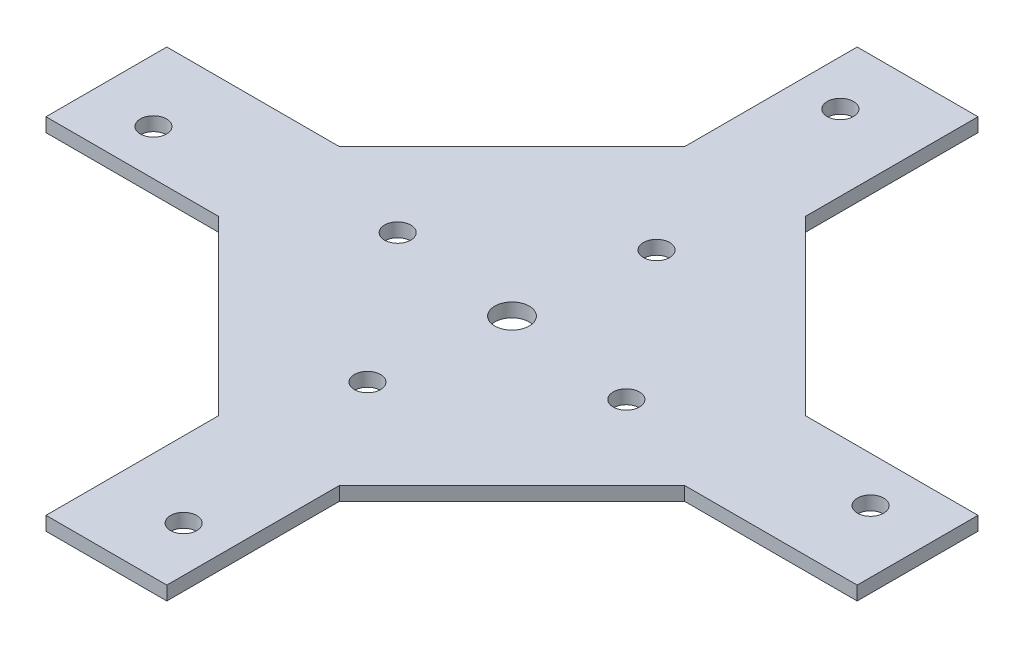
ISO-10303-21;
HEADER;
FILE_DESCRIPTION(('STEP AP214'),'2;1');
FILE_NAME('part.step','',(''),(''),'','','');
FILE_SCHEMA(('AUTOMOTIVE_DESIGN { 1 0 10303 214 1 1 1 1 }'));
ENDSEC;
DATA;
#1=APPLICATION_CONTEXT('core data for automotive mechanical design processes');
#2=APPLICATION_PROTOCOL_DEFINITION('international standard','automotive_design',2000,#1);
#3=PRODUCT_CONTEXT('',#1,'mechanical');
#4=PRODUCT('Part','Part','',(#3));
#5=PRODUCT_RELATED_PRODUCT_CATEGORY('part','',(#4));
#6=PRODUCT_DEFINITION_FORMATION('','',#4);
#7=PRODUCT_DEFINITION_CONTEXT('part definition',#1,'design');
#8=PRODUCT_DEFINITION('design','',#6,#7);
#9=PRODUCT_DEFINITION_SHAPE('','',#8);
#10=(LENGTH_UNIT() NAMED_UNIT(*) SI_UNIT(.MILLI.,.METRE.));
#11=(NAMED_UNIT(*) PLANE_ANGLE_UNIT() SI_UNIT($,.RADIAN.));
#12=(NAMED_UNIT(*) SI_UNIT($,.STERADIAN.) SOLID_ANGLE_UNIT());
#13=UNCERTAINTY_MEASURE_WITH_UNIT(LENGTH_MEASURE(1.E-05),#10,'distance_accuracy_value','');
#14=(GEOMETRIC_REPRESENTATION_CONTEXT(3) GLOBAL_UNCERTAINTY_ASSIGNED_CONTEXT((#13)) GLOBAL_UNIT_ASSIGNED_CONTEXT((#10,
#11,#12)) REPRESENTATION_CONTEXT('',''));
#15=CARTESIAN_POINT('',(0.,0.,0.));
#16=DIRECTION('',(0.,0.,1.));
#17=DIRECTION('',(1.,0.,0.));
#18=AXIS2_PLACEMENT_3D('',#15,#16,#17);
#19=CARTESIAN_POINT('',(0.,2.54,0.));
#20=DIRECTION('',(0.,-1.,0.));
#21=DIRECTION('',(0.,0.,-1.));
#22=AXIS2_PLACEMENT_3D('',#19,#20,#21);
#23=PLANE('',#22);
#24=CARTESIAN_POINT('',(0.,2.54,0.));
#25=DIRECTION('',(0.,1.,0.));
#26=DIRECTION('',(0.,0.,1.));
#27=AXIS2_PLACEMENT_3D('',#24,#25,#26);
#28=CIRCLE('',#27,3.175);
#29=CARTESIAN_POINT('',(0.,2.54,3.175));
#30=VERTEX_POINT('',#29);
#31=EDGE_CURVE('E407',#30,#30,#28,.T.);
#32=ORIENTED_EDGE('',*,*,#31,.F.);
#33=EDGE_LOOP('',(#32));
#34=FACE_BOUND('',#33,.T.);
#35=DIRECTION('',(-1.,0.,0.));
#36=VECTOR('',#35,1.);
#37=CARTESIAN_POINT('',(-74.6125000000004,2.54,-11.1125000000003));
#38=LINE('',#37,#36);
#39=CARTESIAN_POINT('',(-42.8625000000031,2.54,-11.1125000000003));
#40=VERTEX_POINT('',#39);
#41=CARTESIAN_POINT('',(-74.6125000000004,2.54,-11.1125000000003));
#42=VERTEX_POINT('',#41);
#43=EDGE_CURVE('E236',#40,#42,#38,.T.);
#44=ORIENTED_EDGE('',*,*,#43,.T.);
#45=DIRECTION('',(0.,0.,1.));
#46=VECTOR('',#45,1.);
#47=CARTESIAN_POINT('',(-74.6125,2.54,11.112500000009));
#48=LINE('',#47,#46);
#49=CARTESIAN_POINT('',(-74.6125,2.54,11.112500000009));
#50=VERTEX_POINT('',#49);
#51=EDGE_CURVE('E124',#42,#50,#48,.T.);
#52=ORIENTED_EDGE('',*,*,#51,.T.);
#53=DIRECTION('',(1.,0.,0.));
#54=VECTOR('',#53,1.);
#55=CARTESIAN_POINT('',(-74.6125,2.54,11.112500000009));
#56=LINE('',#55,#54);
#57=CARTESIAN_POINT('',(-42.8625000000026,2.54,11.1125000000089));
#58=VERTEX_POINT('',#57);
#59=EDGE_CURVE('E289',#50,#58,#56,.T.);
#60=ORIENTED_EDGE('',*,*,#59,.T.);
#61=DIRECTION('',(0.707106781186541,0.,0.707106781186554));
#62=VECTOR('',#61,1.);
#63=CARTESIAN_POINT('',(-42.8625000000026,2.54,11.1125000000089));
#64=LINE('',#63,#62);
#65=CARTESIAN_POINT('',(-11.1125,2.54,42.8625000000121));
#66=VERTEX_POINT('',#65);
#67=EDGE_CURVE('E309',#58,#66,#64,.T.);
#68=ORIENTED_EDGE('',*,*,#67,.T.);
#69=DIRECTION('',(0.,0.,1.));
#70=VECTOR('',#69,1.);
#71=CARTESIAN_POINT('',(-11.1124999999997,2.54,74.6125000000073));
#72=LINE('',#71,#70);
#73=CARTESIAN_POINT('',(-11.1124999999997,2.54,74.6125000000073));
#74=VERTEX_POINT('',#73);
#75=EDGE_CURVE('E305',#66,#74,#72,.T.);
#76=ORIENTED_EDGE('',*,*,#75,.T.);
#77=DIRECTION('',(1.,0.,0.));
#78=VECTOR('',#77,1.);
#79=CARTESIAN_POINT('',(11.1125000000082,2.54,74.6125000000073));
#80=LINE('',#79,#78);
#81=CARTESIAN_POINT('',(11.1125000000082,2.54,74.6125000000073));
#82=VERTEX_POINT('',#81);
#83=EDGE_CURVE('E308',#74,#82,#80,.T.);
#84=ORIENTED_EDGE('',*,*,#83,.T.);
#85=DIRECTION('',(0.,0.,-1.));
#86=VECTOR('',#85,1.);
#87=CARTESIAN_POINT('',(11.1125000000082,2.54,74.6125000000073));
#88=LINE('',#87,#86);
#89=CARTESIAN_POINT('',(11.1125000000082,2.54,42.8625000000103));
#90=VERTEX_POINT('',#89);
#91=EDGE_CURVE('E313',#82,#90,#88,.T.);
#92=ORIENTED_EDGE('',*,*,#91,.T.);
#93=DIRECTION('',(0.707106781186547,0.,-0.707106781186547));
#94=VECTOR('',#93,1.);
#95=CARTESIAN_POINT('',(42.8625000000114,2.54,11.1125000000072));
#96=LINE('',#95,#94);
#97=CARTESIAN_POINT('',(42.8625000000114,2.54,11.1125000000072));
#98=VERTEX_POINT('',#97);
#99=EDGE_CURVE('E320',#90,#98,#96,.T.);
#100=ORIENTED_EDGE('',*,*,#99,.T.);
#101=DIRECTION('',(1.,0.,0.));
#102=VECTOR('',#101,1.);
#103=CARTESIAN_POINT('',(74.612500000009,2.54,11.112500000008));
#104=LINE('',#103,#102);
#105=CARTESIAN_POINT('',(74.612500000009,2.54,11.112500000008));
#106=VERTEX_POINT('',#105);
#107=EDGE_CURVE('E323',#98,#106,#104,.T.);
#108=ORIENTED_EDGE('',*,*,#107,.T.);
#109=DIRECTION('',(0.,0.,-1.));
#110=VECTOR('',#109,1.);
#111=CARTESIAN_POINT('',(74.6125000000089,2.54,-11.1124999999996));
#112=LINE('',#111,#110);
#113=CARTESIAN_POINT('',(74.6125000000089,2.54,-11.1124999999996));
#114=VERTEX_POINT('',#113);
#115=EDGE_CURVE('E326',#106,#114,#112,.T.);
#116=ORIENTED_EDGE('',*,*,#115,.T.);
#117=DIRECTION('',(-1.,0.,0.));
#118=VECTOR('',#117,1.);
#119=CARTESIAN_POINT('',(74.6125000000089,2.54,-11.1124999999996));
#120=LINE('',#119,#118);
#121=CARTESIAN_POINT('',(42.8625000000113,2.54,-11.1125));
#122=VERTEX_POINT('',#121);
#123=EDGE_CURVE('E329',#114,#122,#120,.T.);
#124=ORIENTED_EDGE('',*,*,#123,.T.);
#125=DIRECTION('',(-0.707106781186548,0.,-0.707106781186548));
#126=VECTOR('',#125,1.);
#127=CARTESIAN_POINT('',(11.1125000000077,2.54,-42.8625000000036));
#128=LINE('',#127,#126);
#129=CARTESIAN_POINT('',(11.1125000000077,2.54,-42.8625000000036));
#130=VERTEX_POINT('',#129);
#131=EDGE_CURVE('E332',#122,#130,#128,.T.);
#132=ORIENTED_EDGE('',*,*,#131,.T.);
#133=DIRECTION('',(0.,0.,-1.));
#134=VECTOR('',#133,1.);
#135=CARTESIAN_POINT('',(11.1125000000077,2.54,-74.6125000000008));
#136=LINE('',#135,#134);
#137=CARTESIAN_POINT('',(11.1125000000077,2.54,-74.6125000000008));
#138=VERTEX_POINT('',#137);
#139=EDGE_CURVE('E167',#130,#138,#136,.T.);
#140=ORIENTED_EDGE('',*,*,#139,.T.);
#141=DIRECTION('',(-1.,0.,0.));
#142=VECTOR('',#141,1.);
#143=CARTESIAN_POINT('',(-11.1124999999999,2.54,-74.6125000000008));
#144=LINE('',#143,#142);
#145=CARTESIAN_POINT('',(-11.1124999999999,2.54,-74.6125000000008));
#146=VERTEX_POINT('',#145);
#147=EDGE_CURVE('E161',#138,#146,#144,.T.);
#148=ORIENTED_EDGE('',*,*,#147,.T.);
#149=DIRECTION('',(0.,0.,1.));
#150=VECTOR('',#149,1.);
#151=CARTESIAN_POINT('',(-11.1124999999999,2.54,-74.6125000000008));
#152=LINE('',#151,#150);
#153=CARTESIAN_POINT('',(-11.1124999999999,2.54,-42.8625000000034));
#154=VERTEX_POINT('',#153);
#155=EDGE_CURVE('E165',#146,#154,#152,.T.);
#156=ORIENTED_EDGE('',*,*,#155,.T.);
#157=DIRECTION('',(-0.707106781186548,0.,0.707106781186548));
#158=VECTOR('',#157,1.);
#159=CARTESIAN_POINT('',(-42.8625000000031,2.54,-11.1125000000003));
#160=LINE('',#159,#158);
#161=EDGE_CURVE('E57',#154,#40,#160,.T.);
#162=ORIENTED_EDGE('',*,*,#161,.T.);
#163=EDGE_LOOP('',(#44,#52,#60,#68,#76,#84,#92,#100,#108,#116,#124,#132,#140,#148,#156,#162));
#164=FACE_BOUND('',#163,.T.);
#165=CARTESIAN_POINT('',(-23.8124999999956,2.54,-2.778125));
#166=DIRECTION('',(0.,1.,0.));
#167=DIRECTION('',(0.,0.,1.));
#168=AXIS2_PLACEMENT_3D('',#165,#166,#167);
#169=CIRCLE('',#168,2.41299999999576);
#170=CARTESIAN_POINT('',(-23.8124999999956,2.54,-0.365125000004236));
#171=VERTEX_POINT('',#170);
#172=EDGE_CURVE('E194',#171,#171,#169,.T.);
#173=ORIENTED_EDGE('',*,*,#172,.F.);
#174=EDGE_LOOP('',(#173));
#175=FACE_BOUND('',#174,.T.);
#176=CARTESIAN_POINT('',(-63.1825,2.54,2.77812500000001));
#177=DIRECTION('',(0.,1.,0.));
#178=DIRECTION('',(0.,0.,1.));
#179=AXIS2_PLACEMENT_3D('',#176,#177,#178);
#180=CIRCLE('',#179,2.413);
#181=CARTESIAN_POINT('',(-63.1825,2.54,5.19112500000001));
#182=VERTEX_POINT('',#181);
#183=EDGE_CURVE('E462',#182,#182,#180,.T.);
#184=ORIENTED_EDGE('',*,*,#183,.F.);
#185=EDGE_LOOP('',(#184));
#186=FACE_BOUND('',#185,.T.);
#187=CARTESIAN_POINT('',(2.77812500000008,2.54,-23.8124999999956));
#188=DIRECTION('',(0.,1.,0.));
#189=DIRECTION('',(0.,0.,1.));
#190=AXIS2_PLACEMENT_3D('',#187,#188,#189);
#191=CIRCLE('',#190,2.41299999999576);
#192=CARTESIAN_POINT('',(2.77812500000008,2.54,-21.3994999999998));
#193=VERTEX_POINT('',#192);
#194=EDGE_CURVE('E454',#193,#193,#191,.T.);
#195=ORIENTED_EDGE('',*,*,#194,.F.);
#196=EDGE_LOOP('',(#195));
#197=FACE_BOUND('',#196,.T.);
#198=CARTESIAN_POINT('',(-2.77812499999979,2.54,-63.1825));
#199=DIRECTION('',(0.,1.,0.));
#200=DIRECTION('',(0.,0.,1.));
#201=AXIS2_PLACEMENT_3D('',#198,#199,#200);
#202=CIRCLE('',#201,2.413);
#203=CARTESIAN_POINT('',(-2.77812499999979,2.54,-60.7695));
#204=VERTEX_POINT('',#203);
#205=EDGE_CURVE('E446',#204,#204,#202,.T.);
#206=ORIENTED_EDGE('',*,*,#205,.F.);
#207=EDGE_LOOP('',(#206));
#208=FACE_BOUND('',#207,.T.);
#209=CARTESIAN_POINT('',(23.8124999999955,2.54,2.77812500000016));
#210=DIRECTION('',(0.,1.,0.));
#211=DIRECTION('',(0.,0.,1.));
#212=AXIS2_PLACEMENT_3D('',#209,#210,#211);
#213=CIRCLE('',#212,2.41299999999576);
#214=CARTESIAN_POINT('',(23.8124999999955,2.54,5.19112499999592));
#215=VERTEX_POINT('',#214);
#216=EDGE_CURVE('E438',#215,#215,#213,.T.);
#217=ORIENTED_EDGE('',*,*,#216,.F.);
#218=EDGE_LOOP('',(#217));
#219=FACE_BOUND('',#218,.T.);
#220=CARTESIAN_POINT('',(63.1825,2.54,-2.77812499999957));
#221=DIRECTION('',(0.,1.,0.));
#222=DIRECTION('',(0.,0.,1.));
#223=AXIS2_PLACEMENT_3D('',#220,#221,#222);
#224=CIRCLE('',#223,2.41299999999999);
#225=CARTESIAN_POINT('',(63.1825,2.54,-0.365124999999579));
#226=VERTEX_POINT('',#225);
#227=EDGE_CURVE('E430',#226,#226,#224,.T.);
#228=ORIENTED_EDGE('',*,*,#227,.F.);
#229=EDGE_LOOP('',(#228));
#230=FACE_BOUND('',#229,.T.);
#231=CARTESIAN_POINT('',(-2.77812500000025,2.54,23.8124999999955));
#232=DIRECTION('',(0.,1.,0.));
#233=DIRECTION('',(0.,0.,1.));
#234=AXIS2_PLACEMENT_3D('',#231,#232,#233);
#235=CIRCLE('',#234,2.41299999999576);
#236=CARTESIAN_POINT('',(-2.77812500000025,2.54,26.2254999999913));
#237=VERTEX_POINT('',#236);
#238=EDGE_CURVE('E422',#237,#237,#235,.T.);
#239=ORIENTED_EDGE('',*,*,#238,.F.);
#240=EDGE_LOOP('',(#239));
#241=FACE_BOUND('',#240,.T.);
#242=CARTESIAN_POINT('',(2.77812499999935,2.54,63.1825));
#243=DIRECTION('',(0.,1.,0.));
#244=DIRECTION('',(0.,0.,1.));
#245=AXIS2_PLACEMENT_3D('',#242,#243,#244);
#246=CIRCLE('',#245,2.41299999999999);
#247=CARTESIAN_POINT('',(2.77812499999935,2.54,65.5955));
#248=VERTEX_POINT('',#247);
#249=EDGE_CURVE('E414',#248,#248,#246,.T.);
#250=ORIENTED_EDGE('',*,*,#249,.F.);
#251=EDGE_LOOP('',(#250));
#252=FACE_BOUND('',#251,.T.);
#253=ADVANCED_FACE('F39',(#34,#164,#175,#186,#197,#208,#219,#230,#241,#252),#23,.F.);
#254=CARTESIAN_POINT('',(0.,0.,0.));
#255=DIRECTION('',(0.,-1.,0.));
#256=DIRECTION('',(0.,0.,-1.));
#257=AXIS2_PLACEMENT_3D('',#254,#255,#256);
#258=PLANE('',#257);
#259=CARTESIAN_POINT('',(0.,0.,0.));
#260=DIRECTION('',(0.,1.,0.));
#261=DIRECTION('',(0.,0.,1.));
#262=AXIS2_PLACEMENT_3D('',#259,#260,#261);
#263=CIRCLE('',#262,3.175);
#264=CARTESIAN_POINT('',(0.,0.,3.175));
#265=VERTEX_POINT('',#264);
#266=EDGE_CURVE('E405',#265,#265,#263,.T.);
#267=ORIENTED_EDGE('',*,*,#266,.T.);
#268=EDGE_LOOP('',(#267));
#269=FACE_BOUND('',#268,.T.);
#270=CARTESIAN_POINT('',(-2.77812500000025,0.,23.8124999999955));
#271=DIRECTION('',(0.,1.,0.));
#272=DIRECTION('',(0.,0.,1.));
#273=AXIS2_PLACEMENT_3D('',#270,#271,#272);
#274=CIRCLE('',#273,2.41299999999576);
#275=CARTESIAN_POINT('',(-2.77812500000025,0.,26.2254999999913));
#276=VERTEX_POINT('',#275);
#277=EDGE_CURVE('E418',#276,#276,#274,.T.);
#278=ORIENTED_EDGE('',*,*,#277,.T.);
#279=EDGE_LOOP('',(#278));
#280=FACE_BOUND('',#279,.T.);
#281=CARTESIAN_POINT('',(23.8124999999955,0.,2.77812500000016));
#282=DIRECTION('',(0.,1.,0.));
#283=DIRECTION('',(0.,0.,1.));
#284=AXIS2_PLACEMENT_3D('',#281,#282,#283);
#285=CIRCLE('',#284,2.41299999999576);
#286=CARTESIAN_POINT('',(23.8124999999955,0.,5.19112499999592));
#287=VERTEX_POINT('',#286);
#288=EDGE_CURVE('E434',#287,#287,#285,.T.);
#289=ORIENTED_EDGE('',*,*,#288,.T.);
#290=EDGE_LOOP('',(#289));
#291=FACE_BOUND('',#290,.T.);
#292=CARTESIAN_POINT('',(2.77812500000008,0.,-23.8124999999956));
#293=DIRECTION('',(0.,1.,0.));
#294=DIRECTION('',(0.,0.,1.));
#295=AXIS2_PLACEMENT_3D('',#292,#293,#294);
#296=CIRCLE('',#295,2.41299999999576);
#297=CARTESIAN_POINT('',(2.77812500000008,0.,-21.3994999999998));
#298=VERTEX_POINT('',#297);
#299=EDGE_CURVE('E450',#298,#298,#296,.T.);
#300=ORIENTED_EDGE('',*,*,#299,.T.);
#301=EDGE_LOOP('',(#300));
#302=FACE_BOUND('',#301,.T.);
#303=CARTESIAN_POINT('',(-23.8124999999956,0.,-2.778125));
#304=DIRECTION('',(0.,1.,0.));
#305=DIRECTION('',(0.,0.,1.));
#306=AXIS2_PLACEMENT_3D('',#303,#304,#305);
#307=CIRCLE('',#306,2.41299999999576);
#308=CARTESIAN_POINT('',(-23.8124999999956,0.,-0.365125000004236));
#309=VERTEX_POINT('',#308);
#310=EDGE_CURVE('E466',#309,#309,#307,.T.);
#311=ORIENTED_EDGE('',*,*,#310,.T.);
#312=EDGE_LOOP('',(#311));
#313=FACE_BOUND('',#312,.T.);
#314=DIRECTION('',(-1.,0.,0.));
#315=VECTOR('',#314,1.);
#316=CARTESIAN_POINT('',(-74.6125000000004,0.,-11.1125000000003));
#317=LINE('',#316,#315);
#318=CARTESIAN_POINT('',(-42.8625000000031,0.,-11.1125000000003));
#319=VERTEX_POINT('',#318);
#320=CARTESIAN_POINT('',(-74.6125000000004,0.,-11.1125000000003));
#321=VERTEX_POINT('',#320);
#322=EDGE_CURVE('E189',#319,#321,#317,.T.);
#323=ORIENTED_EDGE('',*,*,#322,.F.);
#324=DIRECTION('',(-0.707106781186548,0.,0.707106781186548));
#325=VECTOR('',#324,1.);
#326=CARTESIAN_POINT('',(-42.8625000000031,0.,-11.1125000000003));
#327=LINE('',#326,#325);
#328=CARTESIAN_POINT('',(-11.1124999999999,0.,-42.8625000000034));
#329=VERTEX_POINT('',#328);
#330=EDGE_CURVE('E116',#329,#319,#327,.T.);
#331=ORIENTED_EDGE('',*,*,#330,.F.);
#332=DIRECTION('',(0.,0.,1.));
#333=VECTOR('',#332,1.);
#334=CARTESIAN_POINT('',(-11.1124999999999,0.,-74.6125000000008));
#335=LINE('',#334,#333);
#336=CARTESIAN_POINT('',(-11.1124999999999,0.,-74.6125000000008));
#337=VERTEX_POINT('',#336);
#338=EDGE_CURVE('E110',#337,#329,#335,.T.);
#339=ORIENTED_EDGE('',*,*,#338,.F.);
#340=DIRECTION('',(-1.,0.,0.));
#341=VECTOR('',#340,1.);
#342=CARTESIAN_POINT('',(-11.1124999999999,0.,-74.6125000000008));
#343=LINE('',#342,#341);
#344=CARTESIAN_POINT('',(11.1125000000077,0.,-74.6125000000008));
#345=VERTEX_POINT('',#344);
#346=EDGE_CURVE('E176',#345,#337,#343,.T.);
#347=ORIENTED_EDGE('',*,*,#346,.F.);
#348=DIRECTION('',(0.,0.,-1.));
#349=VECTOR('',#348,1.);
#350=CARTESIAN_POINT('',(11.1125000000077,0.,-74.6125000000008));
#351=LINE('',#350,#349);
#352=CARTESIAN_POINT('',(11.1125000000077,0.,-42.8625000000036));
#353=VERTEX_POINT('',#352);
#354=EDGE_CURVE('E227',#353,#345,#351,.T.);
#355=ORIENTED_EDGE('',*,*,#354,.F.);
#356=DIRECTION('',(-0.707106781186548,0.,-0.707106781186548));
#357=VECTOR('',#356,1.);
#358=CARTESIAN_POINT('',(11.1125000000077,0.,-42.8625000000036));
#359=LINE('',#358,#357);
#360=CARTESIAN_POINT('',(42.8625000000113,0.,-11.1125));
#361=VERTEX_POINT('',#360);
#362=EDGE_CURVE('E224',#361,#353,#359,.T.);
#363=ORIENTED_EDGE('',*,*,#362,.F.);
#364=DIRECTION('',(-1.,0.,0.));
#365=VECTOR('',#364,1.);
#366=CARTESIAN_POINT('',(74.6125000000089,0.,-11.1124999999996));
#367=LINE('',#366,#365);
#368=CARTESIAN_POINT('',(74.6125000000089,0.,-11.1124999999996));
#369=VERTEX_POINT('',#368);
#370=EDGE_CURVE('E221',#369,#361,#367,.T.);
#371=ORIENTED_EDGE('',*,*,#370,.F.);
#372=DIRECTION('',(0.,0.,-1.));
#373=VECTOR('',#372,1.);
#374=CARTESIAN_POINT('',(74.6125000000089,0.,-11.1124999999996));
#375=LINE('',#374,#373);
#376=CARTESIAN_POINT('',(74.612500000009,0.,11.112500000008));
#377=VERTEX_POINT('',#376);
#378=EDGE_CURVE('E218',#377,#369,#375,.T.);
#379=ORIENTED_EDGE('',*,*,#378,.F.);
#380=DIRECTION('',(1.,0.,0.));
#381=VECTOR('',#380,1.);
#382=CARTESIAN_POINT('',(74.612500000009,0.,11.112500000008));
#383=LINE('',#382,#381);
#384=CARTESIAN_POINT('',(42.8625000000114,0.,11.1125000000072));
#385=VERTEX_POINT('',#384);
#386=EDGE_CURVE('E215',#385,#377,#383,.T.);
#387=ORIENTED_EDGE('',*,*,#386,.F.);
#388=DIRECTION('',(0.707106781186547,0.,-0.707106781186547));
#389=VECTOR('',#388,1.);
#390=CARTESIAN_POINT('',(42.8625000000114,0.,11.1125000000072));
#391=LINE('',#390,#389);
#392=CARTESIAN_POINT('',(11.1125000000082,0.,42.8625000000103));
#393=VERTEX_POINT('',#392);
#394=EDGE_CURVE('E212',#393,#385,#391,.T.);
#395=ORIENTED_EDGE('',*,*,#394,.F.);
#396=DIRECTION('',(0.,0.,-1.));
#397=VECTOR('',#396,1.);
#398=CARTESIAN_POINT('',(11.1125000000082,0.,74.6125000000073));
#399=LINE('',#398,#397);
#400=CARTESIAN_POINT('',(11.1125000000082,0.,74.6125000000073));
#401=VERTEX_POINT('',#400);
#402=EDGE_CURVE('E209',#401,#393,#399,.T.);
#403=ORIENTED_EDGE('',*,*,#402,.F.);
#404=DIRECTION('',(1.,0.,0.));
#405=VECTOR('',#404,1.);
#406=CARTESIAN_POINT('',(11.1125000000082,0.,74.6125000000073));
#407=LINE('',#406,#405);
#408=CARTESIAN_POINT('',(-11.1124999999997,0.,74.6125000000073));
#409=VERTEX_POINT('',#408);
#410=EDGE_CURVE('E206',#409,#401,#407,.T.);
#411=ORIENTED_EDGE('',*,*,#410,.F.);
#412=DIRECTION('',(0.,0.,1.));
#413=VECTOR('',#412,1.);
#414=CARTESIAN_POINT('',(-11.1124999999997,0.,74.6125000000073));
#415=LINE('',#414,#413);
#416=CARTESIAN_POINT('',(-11.1125,0.,42.8625000000121));
#417=VERTEX_POINT('',#416);
#418=EDGE_CURVE('E203',#417,#409,#415,.T.);
#419=ORIENTED_EDGE('',*,*,#418,.F.);
#420=DIRECTION('',(0.707106781186541,0.,0.707106781186554));
#421=VECTOR('',#420,1.);
#422=CARTESIAN_POINT('',(-42.8625000000026,0.,11.1125000000089));
#423=LINE('',#422,#421);
#424=CARTESIAN_POINT('',(-42.8625000000026,0.,11.1125000000089));
#425=VERTEX_POINT('',#424);
#426=EDGE_CURVE('E200',#425,#417,#423,.T.);
#427=ORIENTED_EDGE('',*,*,#426,.F.);
#428=DIRECTION('',(1.,0.,0.));
#429=VECTOR('',#428,1.);
#430=CARTESIAN_POINT('',(-74.6125,0.,11.112500000009));
#431=LINE('',#430,#429);
#432=CARTESIAN_POINT('',(-74.6125,0.,11.112500000009));
#433=VERTEX_POINT('',#432);
#434=EDGE_CURVE('E197',#433,#425,#431,.T.);
#435=ORIENTED_EDGE('',*,*,#434,.F.);
#436=DIRECTION('',(0.,0.,1.));
#437=VECTOR('',#436,1.);
#438=CARTESIAN_POINT('',(-74.6125,0.,11.112500000009));
#439=LINE('',#438,#437);
#440=EDGE_CURVE('E193',#321,#433,#439,.T.);
#441=ORIENTED_EDGE('',*,*,#440,.F.);
#442=EDGE_LOOP('',(#323,#331,#339,#347,#355,#363,#371,#379,#387,#395,#403,#411,#419,#427,#435,#441));
#443=FACE_BOUND('',#442,.T.);
#444=CARTESIAN_POINT('',(-63.1825,0.,2.77812500000001));
#445=DIRECTION('',(0.,1.,0.));
#446=DIRECTION('',(0.,0.,1.));
#447=AXIS2_PLACEMENT_3D('',#444,#445,#446);
#448=CIRCLE('',#447,2.413);
#449=CARTESIAN_POINT('',(-63.1825,0.,5.19112500000001));
#450=VERTEX_POINT('',#449);
#451=EDGE_CURVE('E458',#450,#450,#448,.T.);
#452=ORIENTED_EDGE('',*,*,#451,.T.);
#453=EDGE_LOOP('',(#452));
#454=FACE_BOUND('',#453,.T.);
#455=CARTESIAN_POINT('',(-2.77812499999979,0.,-63.1825));
#456=DIRECTION('',(0.,1.,0.));
#457=DIRECTION('',(0.,0.,1.));
#458=AXIS2_PLACEMENT_3D('',#455,#456,#457);
#459=CIRCLE('',#458,2.413);
#460=CARTESIAN_POINT('',(-2.77812499999979,0.,-60.7695));
#461=VERTEX_POINT('',#460);
#462=EDGE_CURVE('E442',#461,#461,#459,.T.);
#463=ORIENTED_EDGE('',*,*,#462,.T.);
#464=EDGE_LOOP('',(#463));
#465=FACE_BOUND('',#464,.T.);
#466=CARTESIAN_POINT('',(63.1825,0.,-2.77812499999957));
#467=DIRECTION('',(0.,1.,0.));
#468=DIRECTION('',(0.,0.,1.));
#469=AXIS2_PLACEMENT_3D('',#466,#467,#468);
#470=CIRCLE('',#469,2.41299999999999);
#471=CARTESIAN_POINT('',(63.1825,0.,-0.365124999999579));
#472=VERTEX_POINT('',#471);
#473=EDGE_CURVE('E426',#472,#472,#470,.T.);
#474=ORIENTED_EDGE('',*,*,#473,.T.);
#475=EDGE_LOOP('',(#474));
#476=FACE_BOUND('',#475,.T.);
#477=CARTESIAN_POINT('',(2.77812499999935,0.,63.1825));
#478=DIRECTION('',(0.,1.,0.));
#479=DIRECTION('',(0.,0.,1.));
#480=AXIS2_PLACEMENT_3D('',#477,#478,#479);
#481=CIRCLE('',#480,2.41299999999999);
#482=CARTESIAN_POINT('',(2.77812499999935,0.,65.5955));
#483=VERTEX_POINT('',#482);
#484=EDGE_CURVE('E411',#483,#483,#481,.T.);
#485=ORIENTED_EDGE('',*,*,#484,.T.);
#486=EDGE_LOOP('',(#485));
#487=FACE_BOUND('',#486,.T.);
#488=ADVANCED_FACE('F293',(#269,#280,#291,#302,#313,#443,#454,#465,#476,#487),#258,.T.);
#489=CARTESIAN_POINT('',(-74.6125000000004,2.54,-11.1125000000003));
#490=DIRECTION('',(0.,0.,1.));
#491=DIRECTION('',(1.,0.,0.));
#492=AXIS2_PLACEMENT_3D('',#489,#490,#491);
#493=PLANE('',#492);
#494=ORIENTED_EDGE('',*,*,#322,.T.);
#495=DIRECTION('',(0.,-1.,0.));
#496=VECTOR('',#495,1.);
#497=CARTESIAN_POINT('',(-74.6125000000004,2.54,-11.1125000000003));
#498=LINE('',#497,#496);
#499=EDGE_CURVE('E11',#42,#321,#498,.T.);
#500=ORIENTED_EDGE('',*,*,#499,.F.);
#501=ORIENTED_EDGE('',*,*,#43,.F.);
#502=DIRECTION('',(0.,-1.,0.));
#503=VECTOR('',#502,1.);
#504=CARTESIAN_POINT('',(-42.8625000000031,2.54,-11.1125000000003));
#505=LINE('',#504,#503);
#506=EDGE_CURVE('E185',#40,#319,#505,.T.);
#507=ORIENTED_EDGE('',*,*,#506,.T.);
#508=EDGE_LOOP('',(#494,#500,#501,#507));
#509=FACE_BOUND('',#508,.T.);
#510=ADVANCED_FACE('F41',(#509),#493,.F.);
#511=CARTESIAN_POINT('',(-74.6125,2.54,11.112500000009));
#512=DIRECTION('',(1.,0.,0.));
#513=DIRECTION('',(0.,0.,-1.));
#514=AXIS2_PLACEMENT_3D('',#511,#512,#513);
#515=PLANE('',#514);
#516=ORIENTED_EDGE('',*,*,#440,.T.);
#517=DIRECTION('',(0.,-1.,0.));
#518=VECTOR('',#517,1.);
#519=CARTESIAN_POINT('',(-74.6125,2.54,11.112500000009));
#520=LINE('',#519,#518);
#521=EDGE_CURVE('E49',#50,#433,#520,.T.);
#522=ORIENTED_EDGE('',*,*,#521,.F.);
#523=ORIENTED_EDGE('',*,*,#51,.F.);
#524=ORIENTED_EDGE('',*,*,#499,.T.);
#525=EDGE_LOOP('',(#516,#522,#523,#524));
#526=FACE_BOUND('',#525,.T.);
#527=ADVANCED_FACE('F670',(#526),#515,.F.);
#528=CARTESIAN_POINT('',(-74.6125,2.54,11.112500000009));
#529=DIRECTION('',(0.,0.,-1.));
#530=DIRECTION('',(-1.,0.,0.));
#531=AXIS2_PLACEMENT_3D('',#528,#529,#530);
#532=PLANE('',#531);
#533=ORIENTED_EDGE('',*,*,#434,.T.);
#534=DIRECTION('',(0.,-1.,0.));
#535=VECTOR('',#534,1.);
#536=CARTESIAN_POINT('',(-42.8625000000026,2.54,11.1125000000089));
#537=LINE('',#536,#535);
#538=EDGE_CURVE('E279',#58,#425,#537,.T.);
#539=ORIENTED_EDGE('',*,*,#538,.F.);
#540=ORIENTED_EDGE('',*,*,#59,.F.);
#541=ORIENTED_EDGE('',*,*,#521,.T.);
#542=EDGE_LOOP('',(#533,#539,#540,#541));
#543=FACE_BOUND('',#542,.T.);
#544=ADVANCED_FACE('F287',(#543),#532,.F.);
#545=CARTESIAN_POINT('',(-42.8625000000026,2.54,11.1125000000089));
#546=DIRECTION('',(0.707106781186554,0.,-0.707106781186541));
#547=DIRECTION('',(-0.707106781186541,0.,-0.707106781186554));
#548=AXIS2_PLACEMENT_3D('',#545,#546,#547);
#549=PLANE('',#548);
#550=ORIENTED_EDGE('',*,*,#426,.T.);
#551=DIRECTION('',(0.,-1.,0.));
#552=VECTOR('',#551,1.);
#553=CARTESIAN_POINT('',(-11.1125,2.54,42.8625000000121));
#554=LINE('',#553,#552);
#555=EDGE_CURVE('E275',#66,#417,#554,.T.);
#556=ORIENTED_EDGE('',*,*,#555,.F.);
#557=ORIENTED_EDGE('',*,*,#67,.F.);
#558=ORIENTED_EDGE('',*,*,#538,.T.);
#559=EDGE_LOOP('',(#550,#556,#557,#558));
#560=FACE_BOUND('',#559,.T.);
#561=ADVANCED_FACE('F299',(#560),#549,.F.);
#562=CARTESIAN_POINT('',(-11.1124999999997,2.54,74.6125000000073));
#563=DIRECTION('',(1.,0.,0.));
#564=DIRECTION('',(0.,0.,-1.));
#565=AXIS2_PLACEMENT_3D('',#562,#563,#564);
#566=PLANE('',#565);
#567=ORIENTED_EDGE('',*,*,#418,.T.);
#568=DIRECTION('',(0.,-1.,0.));
#569=VECTOR('',#568,1.);
#570=CARTESIAN_POINT('',(-11.1124999999997,2.54,74.6125000000073));
#571=LINE('',#570,#569);
#572=EDGE_CURVE('E271',#74,#409,#571,.T.);
#573=ORIENTED_EDGE('',*,*,#572,.F.);
#574=ORIENTED_EDGE('',*,*,#75,.F.);
#575=ORIENTED_EDGE('',*,*,#555,.T.);
#576=EDGE_LOOP('',(#567,#573,#574,#575));
#577=FACE_BOUND('',#576,.T.);
#578=ADVANCED_FACE('F303',(#577),#566,.F.);
#579=CARTESIAN_POINT('',(11.1125000000082,2.54,74.6125000000073));
#580=DIRECTION('',(0.,0.,-1.));
#581=DIRECTION('',(-1.,0.,0.));
#582=AXIS2_PLACEMENT_3D('',#579,#580,#581);
#583=PLANE('',#582);
#584=ORIENTED_EDGE('',*,*,#410,.T.);
#585=DIRECTION('',(0.,-1.,0.));
#586=VECTOR('',#585,1.);
#587=CARTESIAN_POINT('',(11.1125000000082,2.54,74.6125000000073));
#588=LINE('',#587,#586);
#589=EDGE_CURVE('E267',#82,#401,#588,.T.);
#590=ORIENTED_EDGE('',*,*,#589,.F.);
#591=ORIENTED_EDGE('',*,*,#83,.F.);
#592=ORIENTED_EDGE('',*,*,#572,.T.);
#593=EDGE_LOOP('',(#584,#590,#591,#592));
#594=FACE_BOUND('',#593,.T.);
#595=ADVANCED_FACE('F635',(#594),#583,.F.);
#596=CARTESIAN_POINT('',(11.1125000000082,2.54,74.6125000000073));
#597=DIRECTION('',(-1.,0.,0.));
#598=DIRECTION('',(0.,0.,1.));
#599=AXIS2_PLACEMENT_3D('',#596,#597,#598);
#600=PLANE('',#599);
#601=ORIENTED_EDGE('',*,*,#402,.T.);
#602=DIRECTION('',(0.,-1.,0.));
#603=VECTOR('',#602,1.);
#604=CARTESIAN_POINT('',(11.1125000000082,2.54,42.8625000000103));
#605=LINE('',#604,#603);
#606=EDGE_CURVE('E263',#90,#393,#605,.T.);
#607=ORIENTED_EDGE('',*,*,#606,.F.);
#608=ORIENTED_EDGE('',*,*,#91,.F.);
#609=ORIENTED_EDGE('',*,*,#589,.T.);
#610=EDGE_LOOP('',(#601,#607,#608,#609));
#611=FACE_BOUND('',#610,.T.);
#612=ADVANCED_FACE('F625',(#611),#600,.F.);
#613=CARTESIAN_POINT('',(42.8625000000114,2.54,11.1125000000072));
#614=DIRECTION('',(-0.707106781186548,0.,-0.707106781186547));
#615=DIRECTION('',(-0.707106781186547,0.,0.707106781186548));
#616=AXIS2_PLACEMENT_3D('',#613,#614,#615);
#617=PLANE('',#616);
#618=ORIENTED_EDGE('',*,*,#394,.T.);
#619=DIRECTION('',(0.,-1.,0.));
#620=VECTOR('',#619,1.);
#621=CARTESIAN_POINT('',(42.8625000000114,2.54,11.1125000000072));
#622=LINE('',#621,#620);
#623=EDGE_CURVE('E259',#98,#385,#622,.T.);
#624=ORIENTED_EDGE('',*,*,#623,.F.);
#625=ORIENTED_EDGE('',*,*,#99,.F.);
#626=ORIENTED_EDGE('',*,*,#606,.T.);
#627=EDGE_LOOP('',(#618,#624,#625,#626));
#628=FACE_BOUND('',#627,.T.);
#629=ADVANCED_FACE('F615',(#628),#617,.F.);
#630=CARTESIAN_POINT('',(74.612500000009,2.54,11.112500000008));
#631=DIRECTION('',(0.,0.,-1.));
#632=DIRECTION('',(-1.,0.,0.));
#633=AXIS2_PLACEMENT_3D('',#630,#631,#632);
#634=PLANE('',#633);
#635=ORIENTED_EDGE('',*,*,#386,.T.);
#636=DIRECTION('',(0.,-1.,0.));
#637=VECTOR('',#636,1.);
#638=CARTESIAN_POINT('',(74.612500000009,2.54,11.112500000008));
#639=LINE('',#638,#637);
#640=EDGE_CURVE('E255',#106,#377,#639,.T.);
#641=ORIENTED_EDGE('',*,*,#640,.F.);
#642=ORIENTED_EDGE('',*,*,#107,.F.);
#643=ORIENTED_EDGE('',*,*,#623,.T.);
#644=EDGE_LOOP('',(#635,#641,#642,#643));
#645=FACE_BOUND('',#644,.T.);
#646=ADVANCED_FACE('F605',(#645),#634,.F.);
#647=CARTESIAN_POINT('',(74.6125000000089,2.54,-11.1124999999996));
#648=DIRECTION('',(-1.,0.,0.));
#649=DIRECTION('',(0.,0.,1.));
#650=AXIS2_PLACEMENT_3D('',#647,#648,#649);
#651=PLANE('',#650);
#652=ORIENTED_EDGE('',*,*,#378,.T.);
#653=DIRECTION('',(0.,-1.,0.));
#654=VECTOR('',#653,1.);
#655=CARTESIAN_POINT('',(74.6125000000089,2.54,-11.1124999999996));
#656=LINE('',#655,#654);
#657=EDGE_CURVE('E251',#114,#369,#656,.T.);
#658=ORIENTED_EDGE('',*,*,#657,.F.);
#659=ORIENTED_EDGE('',*,*,#115,.F.);
#660=ORIENTED_EDGE('',*,*,#640,.T.);
#661=EDGE_LOOP('',(#652,#658,#659,#660));
#662=FACE_BOUND('',#661,.T.);
#663=ADVANCED_FACE('F595',(#662),#651,.F.);
#664=CARTESIAN_POINT('',(74.6125000000089,2.54,-11.1124999999996));
#665=DIRECTION('',(0.,0.,1.));
#666=DIRECTION('',(1.,0.,0.));
#667=AXIS2_PLACEMENT_3D('',#664,#665,#666);
#668=PLANE('',#667);
#669=ORIENTED_EDGE('',*,*,#370,.T.);
#670=DIRECTION('',(0.,-1.,0.));
#671=VECTOR('',#670,1.);
#672=CARTESIAN_POINT('',(42.8625000000113,2.54,-11.1125));
#673=LINE('',#672,#671);
#674=EDGE_CURVE('E247',#122,#361,#673,.T.);
#675=ORIENTED_EDGE('',*,*,#674,.F.);
#676=ORIENTED_EDGE('',*,*,#123,.F.);
#677=ORIENTED_EDGE('',*,*,#657,.T.);
#678=EDGE_LOOP('',(#669,#675,#676,#677));
#679=FACE_BOUND('',#678,.T.);
#680=ADVANCED_FACE('F586',(#679),#668,.F.);
#681=CARTESIAN_POINT('',(11.1125000000077,2.54,-42.8625000000036));
#682=DIRECTION('',(-0.707106781186548,0.,0.707106781186547));
#683=DIRECTION('',(0.707106781186547,0.,0.707106781186548));
#684=AXIS2_PLACEMENT_3D('',#681,#682,#683);
#685=PLANE('',#684);
#686=ORIENTED_EDGE('',*,*,#362,.T.);
#687=DIRECTION('',(0.,-1.,0.));
#688=VECTOR('',#687,1.);
#689=CARTESIAN_POINT('',(11.1125000000077,2.54,-42.8625000000036));
#690=LINE('',#689,#688);
#691=EDGE_CURVE('E243',#130,#353,#690,.T.);
#692=ORIENTED_EDGE('',*,*,#691,.F.);
#693=ORIENTED_EDGE('',*,*,#131,.F.);
#694=ORIENTED_EDGE('',*,*,#674,.T.);
#695=EDGE_LOOP('',(#686,#692,#693,#694));
#696=FACE_BOUND('',#695,.T.);
#697=ADVANCED_FACE('F340',(#696),#685,.F.);
#698=CARTESIAN_POINT('',(11.1125000000077,2.54,-74.6125000000008));
#699=DIRECTION('',(-1.,0.,0.));
#700=DIRECTION('',(0.,0.,1.));
#701=AXIS2_PLACEMENT_3D('',#698,#699,#700);
#702=PLANE('',#701);
#703=ORIENTED_EDGE('',*,*,#354,.T.);
#704=DIRECTION('',(0.,-1.,0.));
#705=VECTOR('',#704,1.);
#706=CARTESIAN_POINT('',(11.1125000000077,2.54,-74.6125000000008));
#707=LINE('',#706,#705);
#708=EDGE_CURVE('E178',#138,#345,#707,.T.);
#709=ORIENTED_EDGE('',*,*,#708,.F.);
#710=ORIENTED_EDGE('',*,*,#139,.F.);
#711=ORIENTED_EDGE('',*,*,#691,.T.);
#712=EDGE_LOOP('',(#703,#709,#710,#711));
#713=FACE_BOUND('',#712,.T.);
#714=ADVANCED_FACE('F344',(#713),#702,.F.);
#715=CARTESIAN_POINT('',(-11.1124999999999,2.54,-74.6125000000008));
#716=DIRECTION('',(0.,0.,1.));
#717=DIRECTION('',(1.,0.,0.));
#718=AXIS2_PLACEMENT_3D('',#715,#716,#717);
#719=PLANE('',#718);
#720=ORIENTED_EDGE('',*,*,#346,.T.);
#721=DIRECTION('',(0.,-1.,0.));
#722=VECTOR('',#721,1.);
#723=CARTESIAN_POINT('',(-11.1124999999999,2.54,-74.6125000000008));
#724=LINE('',#723,#722);
#725=EDGE_CURVE('E173',#146,#337,#724,.T.);
#726=ORIENTED_EDGE('',*,*,#725,.F.);
#727=ORIENTED_EDGE('',*,*,#147,.F.);
#728=ORIENTED_EDGE('',*,*,#708,.T.);
#729=EDGE_LOOP('',(#720,#726,#727,#728));
#730=FACE_BOUND('',#729,.T.);
#731=ADVANCED_FACE('F174',(#730),#719,.F.);
#732=CARTESIAN_POINT('',(-11.1124999999999,2.54,-74.6125000000008));
#733=DIRECTION('',(1.,0.,0.));
#734=DIRECTION('',(0.,0.,-1.));
#735=AXIS2_PLACEMENT_3D('',#732,#733,#734);
#736=PLANE('',#735);
#737=ORIENTED_EDGE('',*,*,#338,.T.);
#738=DIRECTION('',(0.,-1.,0.));
#739=VECTOR('',#738,1.);
#740=CARTESIAN_POINT('',(-11.1124999999999,2.54,-42.8625000000034));
#741=LINE('',#740,#739);
#742=EDGE_CURVE('E179',#154,#329,#741,.T.);
#743=ORIENTED_EDGE('',*,*,#742,.F.);
#744=ORIENTED_EDGE('',*,*,#155,.F.);
#745=ORIENTED_EDGE('',*,*,#725,.T.);
#746=EDGE_LOOP('',(#737,#743,#744,#745));
#747=FACE_BOUND('',#746,.T.);
#748=ADVANCED_FACE('F181',(#747),#736,.F.);
#749=CARTESIAN_POINT('',(-42.8625000000031,2.54,-11.1125000000003));
#750=DIRECTION('',(0.707106781186547,0.,0.707106781186548));
#751=DIRECTION('',(0.707106781186548,0.,-0.707106781186547));
#752=AXIS2_PLACEMENT_3D('',#749,#750,#751);
#753=PLANE('',#752);
#754=ORIENTED_EDGE('',*,*,#330,.T.);
#755=ORIENTED_EDGE('',*,*,#506,.F.);
#756=ORIENTED_EDGE('',*,*,#161,.F.);
#757=ORIENTED_EDGE('',*,*,#742,.T.);
#758=EDGE_LOOP('',(#754,#755,#756,#757));
#759=FACE_BOUND('',#758,.T.);
#760=ADVANCED_FACE('F348',(#759),#753,.F.);
#761=CARTESIAN_POINT('',(-23.8124999999956,2.54,-2.778125));
#762=DIRECTION('',(0.,-1.,0.));
#763=DIRECTION('',(0.,0.,-1.));
#764=AXIS2_PLACEMENT_3D('',#761,#762,#763);
#765=CYLINDRICAL_SURFACE('',#764,2.41299999999576);
#766=ORIENTED_EDGE('',*,*,#172,.T.);
#767=EDGE_LOOP('',(#766));
#768=FACE_BOUND('',#767,.T.);
#769=ORIENTED_EDGE('',*,*,#310,.F.);
#770=EDGE_LOOP('',(#769));
#771=FACE_BOUND('',#770,.T.);
#772=ADVANCED_FACE('F350',(#768,#771),#765,.F.);
#773=CARTESIAN_POINT('',(-63.1825,2.54,2.77812500000001));
#774=DIRECTION('',(0.,-1.,0.));
#775=DIRECTION('',(0.,0.,-1.));
#776=AXIS2_PLACEMENT_3D('',#773,#774,#775);
#777=CYLINDRICAL_SURFACE('',#776,2.413);
#778=ORIENTED_EDGE('',*,*,#183,.T.);
#779=EDGE_LOOP('',(#778));
#780=FACE_BOUND('',#779,.T.);
#781=ORIENTED_EDGE('',*,*,#451,.F.);
#782=EDGE_LOOP('',(#781));
#783=FACE_BOUND('',#782,.T.);
#784=ADVANCED_FACE('F356',(#780,#783),#777,.F.);
#785=CARTESIAN_POINT('',(2.77812500000008,2.54,-23.8124999999956));
#786=DIRECTION('',(0.,-1.,0.));
#787=DIRECTION('',(0.,0.,-1.));
#788=AXIS2_PLACEMENT_3D('',#785,#786,#787);
#789=CYLINDRICAL_SURFACE('',#788,2.41299999999576);
#790=ORIENTED_EDGE('',*,*,#194,.T.);
#791=EDGE_LOOP('',(#790));
#792=FACE_BOUND('',#791,.T.);
#793=ORIENTED_EDGE('',*,*,#299,.F.);
#794=EDGE_LOOP('',(#793));
#795=FACE_BOUND('',#794,.T.);
#796=ADVANCED_FACE('F372',(#792,#795),#789,.F.);
#797=CARTESIAN_POINT('',(-2.77812499999979,2.54,-63.1825));
#798=DIRECTION('',(0.,-1.,0.));
#799=DIRECTION('',(0.,0.,-1.));
#800=AXIS2_PLACEMENT_3D('',#797,#798,#799);
#801=CYLINDRICAL_SURFACE('',#800,2.413);
#802=ORIENTED_EDGE('',*,*,#205,.T.);
#803=EDGE_LOOP('',(#802));
#804=FACE_BOUND('',#803,.T.);
#805=ORIENTED_EDGE('',*,*,#462,.F.);
#806=EDGE_LOOP('',(#805));
#807=FACE_BOUND('',#806,.T.);
#808=ADVANCED_FACE('F376',(#804,#807),#801,.F.);
#809=CARTESIAN_POINT('',(23.8124999999955,2.54,2.77812500000016));
#810=DIRECTION('',(0.,-1.,0.));
#811=DIRECTION('',(0.,0.,-1.));
#812=AXIS2_PLACEMENT_3D('',#809,#810,#811);
#813=CYLINDRICAL_SURFACE('',#812,2.41299999999576);
#814=ORIENTED_EDGE('',*,*,#216,.T.);
#815=EDGE_LOOP('',(#814));
#816=FACE_BOUND('',#815,.T.);
#817=ORIENTED_EDGE('',*,*,#288,.F.);
#818=EDGE_LOOP('',(#817));
#819=FACE_BOUND('',#818,.T.);
#820=ADVANCED_FACE('F380',(#816,#819),#813,.F.);
#821=CARTESIAN_POINT('',(63.1825,2.54,-2.77812499999957));
#822=DIRECTION('',(0.,-1.,0.));
#823=DIRECTION('',(0.,0.,-1.));
#824=AXIS2_PLACEMENT_3D('',#821,#822,#823);
#825=CYLINDRICAL_SURFACE('',#824,2.41299999999999);
#826=ORIENTED_EDGE('',*,*,#227,.T.);
#827=EDGE_LOOP('',(#826));
#828=FACE_BOUND('',#827,.T.);
#829=ORIENTED_EDGE('',*,*,#473,.F.);
#830=EDGE_LOOP('',(#829));
#831=FACE_BOUND('',#830,.T.);
#832=ADVANCED_FACE('F384',(#828,#831),#825,.F.);
#833=CARTESIAN_POINT('',(-2.77812500000025,2.54,23.8124999999955));
#834=DIRECTION('',(0.,-1.,0.));
#835=DIRECTION('',(0.,0.,-1.));
#836=AXIS2_PLACEMENT_3D('',#833,#834,#835);
#837=CYLINDRICAL_SURFACE('',#836,2.41299999999576);
#838=ORIENTED_EDGE('',*,*,#238,.T.);
#839=EDGE_LOOP('',(#838));
#840=FACE_BOUND('',#839,.T.);
#841=ORIENTED_EDGE('',*,*,#277,.F.);
#842=EDGE_LOOP('',(#841));
#843=FACE_BOUND('',#842,.T.);
#844=ADVANCED_FACE('F388',(#840,#843),#837,.F.);
#845=CARTESIAN_POINT('',(2.77812499999935,2.54,63.1825));
#846=DIRECTION('',(0.,-1.,0.));
#847=DIRECTION('',(0.,0.,-1.));
#848=AXIS2_PLACEMENT_3D('',#845,#846,#847);
#849=CYLINDRICAL_SURFACE('',#848,2.41299999999999);
#850=ORIENTED_EDGE('',*,*,#249,.T.);
#851=EDGE_LOOP('',(#850));
#852=FACE_BOUND('',#851,.T.);
#853=ORIENTED_EDGE('',*,*,#484,.F.);
#854=EDGE_LOOP('',(#853));
#855=FACE_BOUND('',#854,.T.);
#856=ADVANCED_FACE('F392',(#852,#855),#849,.F.);
#857=CARTESIAN_POINT('',(0.,0.,0.));
#858=DIRECTION('',(0.,1.,0.));
#859=DIRECTION('',(0.,0.,1.));
#860=AXIS2_PLACEMENT_3D('',#857,#858,#859);
#861=CYLINDRICAL_SURFACE('',#860,3.175);
#862=ORIENTED_EDGE('',*,*,#266,.F.);
#863=EDGE_LOOP('',(#862));
#864=FACE_BOUND('',#863,.T.);
#865=ORIENTED_EDGE('',*,*,#31,.T.);
#866=EDGE_LOOP('',(#865));
#867=FACE_BOUND('',#866,.T.);
#868=ADVANCED_FACE('F396',(#864,#867),#861,.F.);
#869=CLOSED_SHELL('',(#253,#488,#510,#527,#544,#561,#578,#595,#612,#629,#646,#663,#680,#697,
#714,#731,#748,#760,#772,#784,#796,#808,#820,#832,#844,#856,#868));
#870=MANIFOLD_SOLID_BREP('B2',#869);
#871=ADVANCED_BREP_SHAPE_REPRESENTATION('',(#18,#870),#14);
#872=SHAPE_DEFINITION_REPRESENTATION(#9,#871);
ENDSEC;
END-ISO-10303-21;
